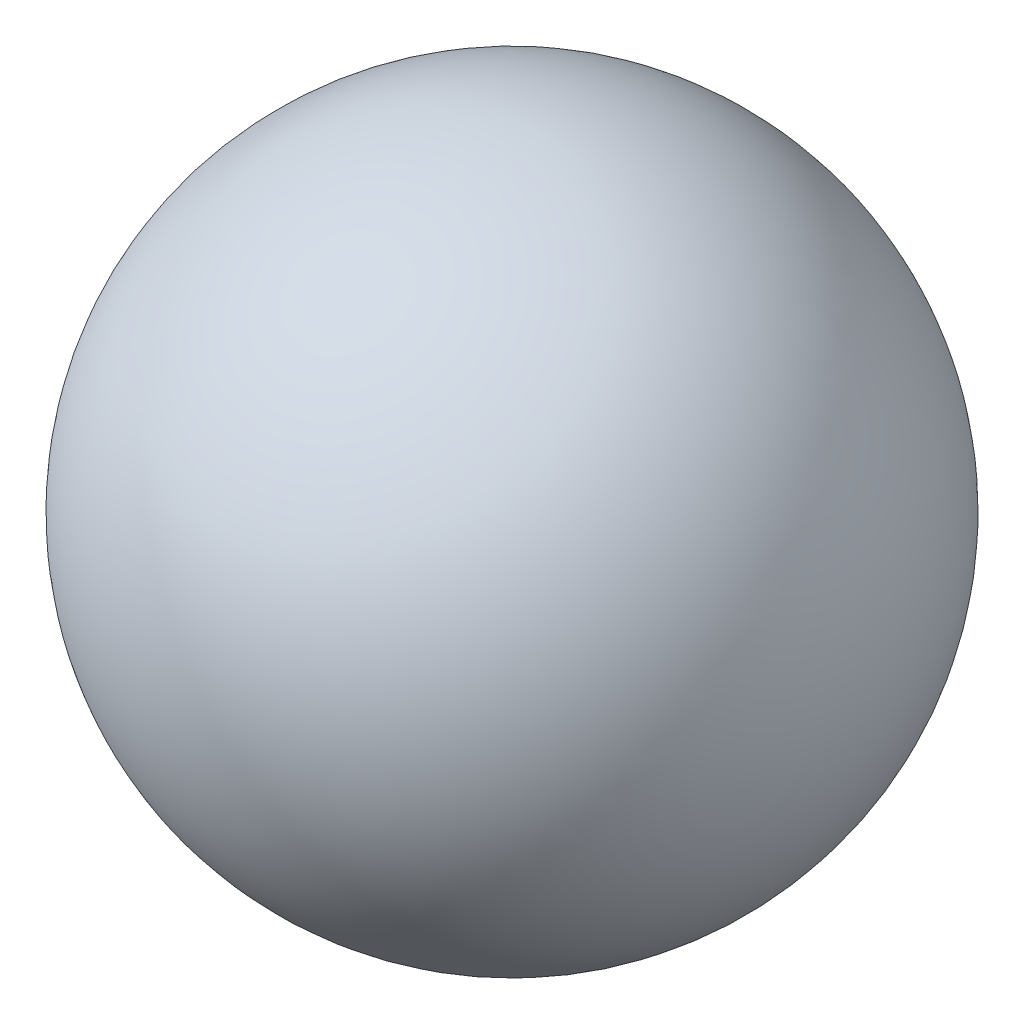
ISO-10303-21;
HEADER;
FILE_DESCRIPTION(('STEP AP214'),'2;1');
FILE_NAME('part.step','',(''),(''),'','','');
FILE_SCHEMA(('AUTOMOTIVE_DESIGN { 1 0 10303 214 1 1 1 1 }'));
ENDSEC;
DATA;
#1=APPLICATION_CONTEXT('core data for automotive mechanical design processes');
#2=APPLICATION_PROTOCOL_DEFINITION('international standard','automotive_design',2000,#1);
#3=PRODUCT_CONTEXT('',#1,'mechanical');
#4=PRODUCT('Part','Part','',(#3));
#5=PRODUCT_RELATED_PRODUCT_CATEGORY('part','',(#4));
#6=PRODUCT_DEFINITION_FORMATION('','',#4);
#7=PRODUCT_DEFINITION_CONTEXT('part definition',#1,'design');
#8=PRODUCT_DEFINITION('design','',#6,#7);
#9=PRODUCT_DEFINITION_SHAPE('','',#8);
#10=(LENGTH_UNIT() NAMED_UNIT(*) SI_UNIT(.MILLI.,.METRE.));
#11=(NAMED_UNIT(*) PLANE_ANGLE_UNIT() SI_UNIT($,.RADIAN.));
#12=(NAMED_UNIT(*) SI_UNIT($,.STERADIAN.) SOLID_ANGLE_UNIT());
#13=UNCERTAINTY_MEASURE_WITH_UNIT(LENGTH_MEASURE(1.E-05),#10,'distance_accuracy_value','');
#14=(GEOMETRIC_REPRESENTATION_CONTEXT(3) GLOBAL_UNCERTAINTY_ASSIGNED_CONTEXT((#13)) GLOBAL_UNIT_ASSIGNED_CONTEXT((#10,
#11,#12)) REPRESENTATION_CONTEXT('',''));
#15=CARTESIAN_POINT('',(0.,0.,0.));
#16=DIRECTION('',(0.,0.,1.));
#17=DIRECTION('',(1.,0.,0.));
#18=AXIS2_PLACEMENT_3D('',#15,#16,#17);
#19=CARTESIAN_POINT('',(6.04599659483406,-3.,-5.23888587156229));
#20=DIRECTION('',(0.,0.,1.));
#21=DIRECTION('',(1.,0.,0.));
#22=AXIS2_PLACEMENT_3D('',#19,#20,#21);
#23=SPHERICAL_SURFACE('',#22,1.8);
#24=CARTESIAN_POINT('',(6.04599659483406,-3.,-3.43888587156229));
#25=VERTEX_POINT('',#24);
#26=VERTEX_LOOP('',#25);
#27=FACE_BOUND('',#26,.T.);
#28=ADVANCED_FACE('F12',(#27),#23,.T.);
#29=CLOSED_SHELL('',(#28));
#30=MANIFOLD_SOLID_BREP('B1',#29);
#31=ADVANCED_BREP_SHAPE_REPRESENTATION('',(#18,#30),#14);
#32=SHAPE_DEFINITION_REPRESENTATION(#9,#31);
ENDSEC;
END-ISO-10303-21;
